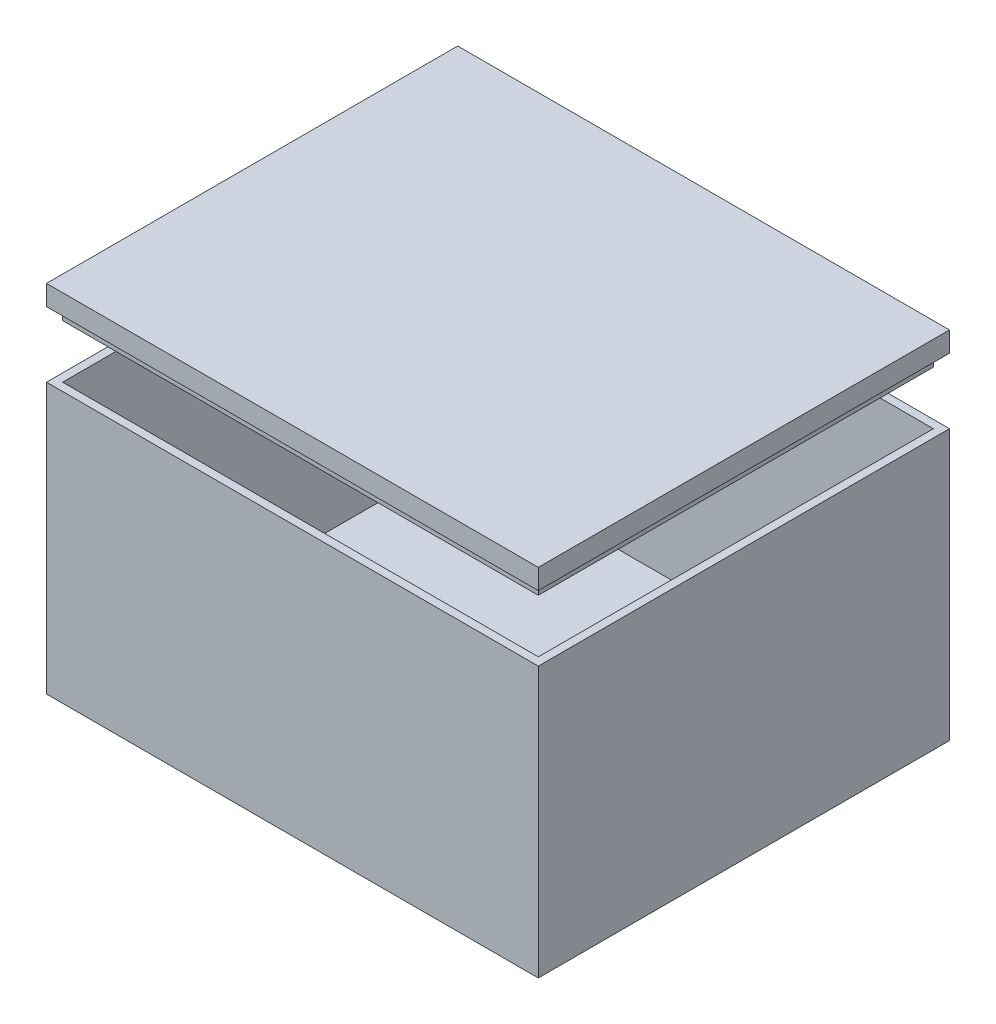
ISO-10303-21;
HEADER;
FILE_DESCRIPTION(('STEP AP214'),'2;1');
FILE_NAME('part.step','',(''),(''),'','','');
FILE_SCHEMA(('AUTOMOTIVE_DESIGN { 1 0 10303 214 1 1 1 1 }'));
ENDSEC;
DATA;
#1=APPLICATION_CONTEXT('core data for automotive mechanical design processes');
#2=APPLICATION_PROTOCOL_DEFINITION('international standard','automotive_design',2000,#1);
#3=PRODUCT_CONTEXT('',#1,'mechanical');
#4=PRODUCT('Part','Part','',(#3));
#5=PRODUCT_RELATED_PRODUCT_CATEGORY('part','',(#4));
#6=PRODUCT_DEFINITION_FORMATION('','',#4);
#7=PRODUCT_DEFINITION_CONTEXT('part definition',#1,'design');
#8=PRODUCT_DEFINITION('design','',#6,#7);
#9=PRODUCT_DEFINITION_SHAPE('','',#8);
#10=(LENGTH_UNIT() NAMED_UNIT(*) SI_UNIT(.MILLI.,.METRE.));
#11=(NAMED_UNIT(*) PLANE_ANGLE_UNIT() SI_UNIT($,.RADIAN.));
#12=(NAMED_UNIT(*) SI_UNIT($,.STERADIAN.) SOLID_ANGLE_UNIT());
#13=UNCERTAINTY_MEASURE_WITH_UNIT(LENGTH_MEASURE(1.E-05),#10,'distance_accuracy_value','');
#14=(GEOMETRIC_REPRESENTATION_CONTEXT(3) GLOBAL_UNCERTAINTY_ASSIGNED_CONTEXT((#13)) GLOBAL_UNIT_ASSIGNED_CONTEXT((#10,
#11,#12)) REPRESENTATION_CONTEXT('',''));
#15=CARTESIAN_POINT('',(0.,0.,0.));
#16=DIRECTION('',(0.,0.,1.));
#17=DIRECTION('',(1.,0.,0.));
#18=AXIS2_PLACEMENT_3D('',#15,#16,#17);
#19=CARTESIAN_POINT('',(0.,83.2232812478183,0.));
#20=DIRECTION('',(0.,1.,0.));
#21=DIRECTION('',(0.,0.,1.));
#22=AXIS2_PLACEMENT_3D('',#19,#20,#21);
#23=PLANE('',#22);
#24=DIRECTION('',(-1.,0.,0.));
#25=VECTOR('',#24,1.);
#26=CARTESIAN_POINT('',(67.4766734279919,83.2232812478183,-28.1135902636917));
#27=LINE('',#26,#25);
#28=CARTESIAN_POINT('',(67.4766734279919,83.2232812478183,-28.1135902636917));
#29=VERTEX_POINT('',#28);
#30=CARTESIAN_POINT('',(-54.5233265720081,83.2232812478183,-28.1135902636917));
#31=VERTEX_POINT('',#30);
#32=EDGE_CURVE('E227',#29,#31,#27,.T.);
#33=ORIENTED_EDGE('',*,*,#32,.F.);
#34=DIRECTION('',(0.,0.,-1.));
#35=VECTOR('',#34,1.);
#36=CARTESIAN_POINT('',(67.4766734279919,83.2232812478183,73.8864097363083));
#37=LINE('',#36,#35);
#38=CARTESIAN_POINT('',(67.4766734279919,83.2232812478183,73.8864097363083));
#39=VERTEX_POINT('',#38);
#40=EDGE_CURVE('E232',#39,#29,#37,.T.);
#41=ORIENTED_EDGE('',*,*,#40,.F.);
#42=DIRECTION('',(1.,0.,0.));
#43=VECTOR('',#42,1.);
#44=CARTESIAN_POINT('',(-54.5233265720081,83.2232812478183,73.8864097363083));
#45=LINE('',#44,#43);
#46=CARTESIAN_POINT('',(-54.5233265720081,83.2232812478183,73.8864097363083));
#47=VERTEX_POINT('',#46);
#48=EDGE_CURVE('E243',#47,#39,#45,.T.);
#49=ORIENTED_EDGE('',*,*,#48,.F.);
#50=DIRECTION('',(0.,0.,1.));
#51=VECTOR('',#50,1.);
#52=CARTESIAN_POINT('',(-54.5233265720081,83.2232812478183,-28.1135902636917));
#53=LINE('',#52,#51);
#54=EDGE_CURVE('E241',#31,#47,#53,.T.);
#55=ORIENTED_EDGE('',*,*,#54,.F.);
#56=EDGE_LOOP('',(#33,#41,#49,#55));
#57=FACE_BOUND('',#56,.T.);
#58=DIRECTION('',(0.,0.,-1.));
#59=VECTOR('',#58,1.);
#60=CARTESIAN_POINT('',(-52.5233265720081,83.2232812478183,71.8864097363083));
#61=LINE('',#60,#59);
#62=CARTESIAN_POINT('',(-52.5233265720081,83.2232812478183,71.8864097363083));
#63=VERTEX_POINT('',#62);
#64=CARTESIAN_POINT('',(-52.5233265720081,83.2232812478183,-26.1135902636917));
#65=VERTEX_POINT('',#64);
#66=EDGE_CURVE('E176',#63,#65,#61,.T.);
#67=ORIENTED_EDGE('',*,*,#66,.F.);
#68=DIRECTION('',(-1.,0.,0.));
#69=VECTOR('',#68,1.);
#70=CARTESIAN_POINT('',(65.4766734279919,83.2232812478183,71.8864097363083));
#71=LINE('',#70,#69);
#72=CARTESIAN_POINT('',(65.4766734279919,83.2232812478183,71.8864097363083));
#73=VERTEX_POINT('',#72);
#74=EDGE_CURVE('E204',#73,#63,#71,.T.);
#75=ORIENTED_EDGE('',*,*,#74,.F.);
#76=DIRECTION('',(0.,0.,1.));
#77=VECTOR('',#76,1.);
#78=CARTESIAN_POINT('',(65.4766734279919,83.2232812478183,-26.1135902636917));
#79=LINE('',#78,#77);
#80=CARTESIAN_POINT('',(65.4766734279919,83.2232812478183,-26.1135902636917));
#81=VERTEX_POINT('',#80);
#82=EDGE_CURVE('E90',#81,#73,#79,.T.);
#83=ORIENTED_EDGE('',*,*,#82,.F.);
#84=DIRECTION('',(1.,0.,0.));
#85=VECTOR('',#84,1.);
#86=CARTESIAN_POINT('',(-52.5233265720081,83.2232812478183,-26.1135902636917));
#87=LINE('',#86,#85);
#88=EDGE_CURVE('E85',#65,#81,#87,.T.);
#89=ORIENTED_EDGE('',*,*,#88,.F.);
#90=EDGE_LOOP('',(#67,#75,#83,#89));
#91=FACE_BOUND('',#90,.T.);
#92=ADVANCED_FACE('F70',(#57,#91),#23,.F.);
#93=CARTESIAN_POINT('',(67.4766734279919,88.2232812478183,-28.1135902636917));
#94=DIRECTION('',(0.,0.,1.));
#95=DIRECTION('',(1.,0.,0.));
#96=AXIS2_PLACEMENT_3D('',#93,#94,#95);
#97=PLANE('',#96);
#98=ORIENTED_EDGE('',*,*,#32,.T.);
#99=DIRECTION('',(0.,-1.,0.));
#100=VECTOR('',#99,1.);
#101=CARTESIAN_POINT('',(-54.5233265720081,88.2232812478183,-28.1135902636917));
#102=LINE('',#101,#100);
#103=CARTESIAN_POINT('',(-54.5233265720081,88.2232812478183,-28.1135902636917));
#104=VERTEX_POINT('',#103);
#105=EDGE_CURVE('E13',#104,#31,#102,.T.);
#106=ORIENTED_EDGE('',*,*,#105,.F.);
#107=DIRECTION('',(-1.,0.,0.));
#108=VECTOR('',#107,1.);
#109=CARTESIAN_POINT('',(67.4766734279919,88.2232812478183,-28.1135902636917));
#110=LINE('',#109,#108);
#111=CARTESIAN_POINT('',(67.4766734279919,88.2232812478183,-28.1135902636917));
#112=VERTEX_POINT('',#111);
#113=EDGE_CURVE('E228',#112,#104,#110,.T.);
#114=ORIENTED_EDGE('',*,*,#113,.F.);
#115=DIRECTION('',(0.,-1.,0.));
#116=VECTOR('',#115,1.);
#117=CARTESIAN_POINT('',(67.4766734279919,88.2232812478183,-28.1135902636917));
#118=LINE('',#117,#116);
#119=EDGE_CURVE('E238',#112,#29,#118,.T.);
#120=ORIENTED_EDGE('',*,*,#119,.T.);
#121=EDGE_LOOP('',(#98,#106,#114,#120));
#122=FACE_BOUND('',#121,.T.);
#123=ADVANCED_FACE('F72',(#122),#97,.F.);
#124=CARTESIAN_POINT('',(-54.5233265720081,88.2232812478183,-28.1135902636917));
#125=DIRECTION('',(1.,0.,0.));
#126=DIRECTION('',(0.,0.,-1.));
#127=AXIS2_PLACEMENT_3D('',#124,#125,#126);
#128=PLANE('',#127);
#129=ORIENTED_EDGE('',*,*,#54,.T.);
#130=DIRECTION('',(0.,-1.,0.));
#131=VECTOR('',#130,1.);
#132=CARTESIAN_POINT('',(-54.5233265720081,88.2232812478183,73.8864097363083));
#133=LINE('',#132,#131);
#134=CARTESIAN_POINT('',(-54.5233265720081,88.2232812478183,73.8864097363083));
#135=VERTEX_POINT('',#134);
#136=EDGE_CURVE('E78',#135,#47,#133,.T.);
#137=ORIENTED_EDGE('',*,*,#136,.F.);
#138=DIRECTION('',(0.,0.,1.));
#139=VECTOR('',#138,1.);
#140=CARTESIAN_POINT('',(-54.5233265720081,88.2232812478183,-28.1135902636917));
#141=LINE('',#140,#139);
#142=EDGE_CURVE('E231',#104,#135,#141,.T.);
#143=ORIENTED_EDGE('',*,*,#142,.F.);
#144=ORIENTED_EDGE('',*,*,#105,.T.);
#145=EDGE_LOOP('',(#129,#137,#143,#144));
#146=FACE_BOUND('',#145,.T.);
#147=ADVANCED_FACE('F270',(#146),#128,.F.);
#148=CARTESIAN_POINT('',(-54.5233265720081,88.2232812478183,73.8864097363083));
#149=DIRECTION('',(0.,0.,-1.));
#150=DIRECTION('',(-1.,0.,0.));
#151=AXIS2_PLACEMENT_3D('',#148,#149,#150);
#152=PLANE('',#151);
#153=ORIENTED_EDGE('',*,*,#48,.T.);
#154=DIRECTION('',(0.,-1.,0.));
#155=VECTOR('',#154,1.);
#156=CARTESIAN_POINT('',(67.4766734279919,88.2232812478183,73.8864097363083));
#157=LINE('',#156,#155);
#158=CARTESIAN_POINT('',(67.4766734279919,88.2232812478183,73.8864097363083));
#159=VERTEX_POINT('',#158);
#160=EDGE_CURVE('E248',#159,#39,#157,.T.);
#161=ORIENTED_EDGE('',*,*,#160,.F.);
#162=DIRECTION('',(1.,0.,0.));
#163=VECTOR('',#162,1.);
#164=CARTESIAN_POINT('',(-54.5233265720081,88.2232812478183,73.8864097363083));
#165=LINE('',#164,#163);
#166=EDGE_CURVE('E234',#135,#159,#165,.T.);
#167=ORIENTED_EDGE('',*,*,#166,.F.);
#168=ORIENTED_EDGE('',*,*,#136,.T.);
#169=EDGE_LOOP('',(#153,#161,#167,#168));
#170=FACE_BOUND('',#169,.T.);
#171=ADVANCED_FACE('F255',(#170),#152,.F.);
#172=CARTESIAN_POINT('',(67.4766734279919,88.2232812478183,73.8864097363083));
#173=DIRECTION('',(-1.,0.,0.));
#174=DIRECTION('',(0.,0.,1.));
#175=AXIS2_PLACEMENT_3D('',#172,#173,#174);
#176=PLANE('',#175);
#177=ORIENTED_EDGE('',*,*,#40,.T.);
#178=ORIENTED_EDGE('',*,*,#119,.F.);
#179=DIRECTION('',(0.,0.,-1.));
#180=VECTOR('',#179,1.);
#181=CARTESIAN_POINT('',(67.4766734279919,88.2232812478183,73.8864097363083));
#182=LINE('',#181,#180);
#183=EDGE_CURVE('E236',#159,#112,#182,.T.);
#184=ORIENTED_EDGE('',*,*,#183,.F.);
#185=ORIENTED_EDGE('',*,*,#160,.T.);
#186=EDGE_LOOP('',(#177,#178,#184,#185));
#187=FACE_BOUND('',#186,.T.);
#188=ADVANCED_FACE('F263',(#187),#176,.F.);
#189=CARTESIAN_POINT('',(0.,88.2232812478183,0.));
#190=DIRECTION('',(0.,1.,0.));
#191=DIRECTION('',(0.,0.,1.));
#192=AXIS2_PLACEMENT_3D('',#189,#190,#191);
#193=PLANE('',#192);
#194=ORIENTED_EDGE('',*,*,#113,.T.);
#195=ORIENTED_EDGE('',*,*,#142,.T.);
#196=ORIENTED_EDGE('',*,*,#166,.T.);
#197=ORIENTED_EDGE('',*,*,#183,.T.);
#198=EDGE_LOOP('',(#194,#195,#196,#197));
#199=FACE_BOUND('',#198,.T.);
#200=ADVANCED_FACE('F269',(#199),#193,.T.);
#201=CARTESIAN_POINT('',(0.,80.2232812478183,0.));
#202=DIRECTION('',(0.,-1.,0.));
#203=DIRECTION('',(0.,0.,-1.));
#204=AXIS2_PLACEMENT_3D('',#201,#202,#203);
#205=PLANE('',#204);
#206=DIRECTION('',(0.,0.,-1.));
#207=VECTOR('',#206,1.);
#208=CARTESIAN_POINT('',(-52.5233265720081,80.2232812478183,71.8864097363083));
#209=LINE('',#208,#207);
#210=CARTESIAN_POINT('',(-52.5233265720081,80.2232812478183,71.8864097363083));
#211=VERTEX_POINT('',#210);
#212=CARTESIAN_POINT('',(-52.5233265720081,80.2232812478183,-26.1135902636917));
#213=VERTEX_POINT('',#212);
#214=EDGE_CURVE('E200',#211,#213,#209,.T.);
#215=ORIENTED_EDGE('',*,*,#214,.T.);
#216=DIRECTION('',(1.,0.,0.));
#217=VECTOR('',#216,1.);
#218=CARTESIAN_POINT('',(-52.5233265720081,80.2232812478183,-26.1135902636917));
#219=LINE('',#218,#217);
#220=CARTESIAN_POINT('',(65.4766734279919,80.2232812478183,-26.1135902636917));
#221=VERTEX_POINT('',#220);
#222=EDGE_CURVE('E203',#213,#221,#219,.T.);
#223=ORIENTED_EDGE('',*,*,#222,.T.);
#224=DIRECTION('',(0.,0.,1.));
#225=VECTOR('',#224,1.);
#226=CARTESIAN_POINT('',(65.4766734279919,80.2232812478183,-26.1135902636917));
#227=LINE('',#226,#225);
#228=CARTESIAN_POINT('',(65.4766734279919,80.2232812478183,71.8864097363083));
#229=VERTEX_POINT('',#228);
#230=EDGE_CURVE('E206',#221,#229,#227,.T.);
#231=ORIENTED_EDGE('',*,*,#230,.T.);
#232=DIRECTION('',(-1.,0.,0.));
#233=VECTOR('',#232,1.);
#234=CARTESIAN_POINT('',(65.4766734279919,80.2232812478183,71.8864097363083));
#235=LINE('',#234,#233);
#236=EDGE_CURVE('E208',#229,#211,#235,.T.);
#237=ORIENTED_EDGE('',*,*,#236,.T.);
#238=EDGE_LOOP('',(#215,#223,#231,#237));
#239=FACE_BOUND('',#238,.T.);
#240=DIRECTION('',(1.,0.,0.));
#241=VECTOR('',#240,1.);
#242=CARTESIAN_POINT('',(-52.5233265720081,80.2232812478183,-24.1135902636917));
#243=LINE('',#242,#241);
#244=CARTESIAN_POINT('',(-50.5233265720081,80.2232812478183,-24.1135902636917));
#245=VERTEX_POINT('',#244);
#246=CARTESIAN_POINT('',(63.4766734279919,80.2232812478183,-24.1135902636917));
#247=VERTEX_POINT('',#246);
#248=EDGE_CURVE('E168',#245,#247,#243,.T.);
#249=ORIENTED_EDGE('',*,*,#248,.F.);
#250=DIRECTION('',(0.,0.,-1.));
#251=VECTOR('',#250,1.);
#252=CARTESIAN_POINT('',(-50.5233265720081,80.2232812478183,71.8864097363083));
#253=LINE('',#252,#251);
#254=CARTESIAN_POINT('',(-50.5233265720081,80.2232812478183,69.8864097363083));
#255=VERTEX_POINT('',#254);
#256=EDGE_CURVE('E158',#255,#245,#253,.T.);
#257=ORIENTED_EDGE('',*,*,#256,.F.);
#258=DIRECTION('',(-1.,0.,0.));
#259=VECTOR('',#258,1.);
#260=CARTESIAN_POINT('',(65.4766734279919,80.2232812478183,69.8864097363083));
#261=LINE('',#260,#259);
#262=CARTESIAN_POINT('',(63.4766734279919,80.2232812478183,69.8864097363083));
#263=VERTEX_POINT('',#262);
#264=EDGE_CURVE('E184',#263,#255,#261,.T.);
#265=ORIENTED_EDGE('',*,*,#264,.F.);
#266=DIRECTION('',(0.,0.,1.));
#267=VECTOR('',#266,1.);
#268=CARTESIAN_POINT('',(63.4766734279919,80.2232812478183,-26.1135902636917));
#269=LINE('',#268,#267);
#270=EDGE_CURVE('E182',#247,#263,#269,.T.);
#271=ORIENTED_EDGE('',*,*,#270,.F.);
#272=EDGE_LOOP('',(#249,#257,#265,#271));
#273=FACE_BOUND('',#272,.T.);
#274=ADVANCED_FACE('F180',(#239,#273),#205,.T.);
#275=CARTESIAN_POINT('',(-52.5233265720081,80.2232812478183,71.8864097363083));
#276=DIRECTION('',(1.,0.,0.));
#277=DIRECTION('',(0.,0.,-1.));
#278=AXIS2_PLACEMENT_3D('',#275,#276,#277);
#279=PLANE('',#278);
#280=ORIENTED_EDGE('',*,*,#66,.T.);
#281=DIRECTION('',(0.,1.,0.));
#282=VECTOR('',#281,1.);
#283=CARTESIAN_POINT('',(-52.5233265720081,80.2232812478183,-26.1135902636917));
#284=LINE('',#283,#282);
#285=EDGE_CURVE('E225',#213,#65,#284,.T.);
#286=ORIENTED_EDGE('',*,*,#285,.F.);
#287=ORIENTED_EDGE('',*,*,#214,.F.);
#288=DIRECTION('',(0.,1.,0.));
#289=VECTOR('',#288,1.);
#290=CARTESIAN_POINT('',(-52.5233265720081,80.2232812478183,71.8864097363083));
#291=LINE('',#290,#289);
#292=EDGE_CURVE('E210',#211,#63,#291,.T.);
#293=ORIENTED_EDGE('',*,*,#292,.T.);
#294=EDGE_LOOP('',(#280,#286,#287,#293));
#295=FACE_BOUND('',#294,.T.);
#296=ADVANCED_FACE('F308',(#295),#279,.F.);
#297=CARTESIAN_POINT('',(-52.5233265720081,80.2232812478183,-26.1135902636917));
#298=DIRECTION('',(0.,0.,1.));
#299=DIRECTION('',(1.,0.,0.));
#300=AXIS2_PLACEMENT_3D('',#297,#298,#299);
#301=PLANE('',#300);
#302=ORIENTED_EDGE('',*,*,#88,.T.);
#303=DIRECTION('',(0.,1.,0.));
#304=VECTOR('',#303,1.);
#305=CARTESIAN_POINT('',(65.4766734279919,80.2232812478183,-26.1135902636917));
#306=LINE('',#305,#304);
#307=EDGE_CURVE('E222',#221,#81,#306,.T.);
#308=ORIENTED_EDGE('',*,*,#307,.F.);
#309=ORIENTED_EDGE('',*,*,#222,.F.);
#310=ORIENTED_EDGE('',*,*,#285,.T.);
#311=EDGE_LOOP('',(#302,#308,#309,#310));
#312=FACE_BOUND('',#311,.T.);
#313=ADVANCED_FACE('F316',(#312),#301,.F.);
#314=CARTESIAN_POINT('',(65.4766734279919,80.2232812478183,-26.1135902636917));
#315=DIRECTION('',(-1.,0.,0.));
#316=DIRECTION('',(0.,0.,1.));
#317=AXIS2_PLACEMENT_3D('',#314,#315,#316);
#318=PLANE('',#317);
#319=ORIENTED_EDGE('',*,*,#82,.T.);
#320=DIRECTION('',(0.,1.,0.));
#321=VECTOR('',#320,1.);
#322=CARTESIAN_POINT('',(65.4766734279919,80.2232812478183,71.8864097363083));
#323=LINE('',#322,#321);
#324=EDGE_CURVE('E219',#229,#73,#323,.T.);
#325=ORIENTED_EDGE('',*,*,#324,.F.);
#326=ORIENTED_EDGE('',*,*,#230,.F.);
#327=ORIENTED_EDGE('',*,*,#307,.T.);
#328=EDGE_LOOP('',(#319,#325,#326,#327));
#329=FACE_BOUND('',#328,.T.);
#330=ADVANCED_FACE('F312',(#329),#318,.F.);
#331=CARTESIAN_POINT('',(65.4766734279919,80.2232812478183,71.8864097363083));
#332=DIRECTION('',(0.,0.,-1.));
#333=DIRECTION('',(-1.,0.,0.));
#334=AXIS2_PLACEMENT_3D('',#331,#332,#333);
#335=PLANE('',#334);
#336=ORIENTED_EDGE('',*,*,#74,.T.);
#337=ORIENTED_EDGE('',*,*,#292,.F.);
#338=ORIENTED_EDGE('',*,*,#236,.F.);
#339=ORIENTED_EDGE('',*,*,#324,.T.);
#340=EDGE_LOOP('',(#336,#337,#338,#339));
#341=FACE_BOUND('',#340,.T.);
#342=ADVANCED_FACE('F305',(#341),#335,.F.);
#343=CARTESIAN_POINT('',(-50.5233265720081,80.2232812478183,71.8864097363083));
#344=DIRECTION('',(1.,0.,0.));
#345=DIRECTION('',(0.,0.,-1.));
#346=AXIS2_PLACEMENT_3D('',#343,#344,#345);
#347=PLANE('',#346);
#348=DIRECTION('',(0.,0.,-1.));
#349=VECTOR('',#348,1.);
#350=CARTESIAN_POINT('',(-50.5233265720081,83.2232812478183,71.8864097363083));
#351=LINE('',#350,#349);
#352=CARTESIAN_POINT('',(-50.5233265720081,83.2232812478183,69.8864097363083));
#353=VERTEX_POINT('',#352);
#354=CARTESIAN_POINT('',(-50.5233265720081,83.2232812478183,-24.1135902636917));
#355=VERTEX_POINT('',#354);
#356=EDGE_CURVE('E188',#353,#355,#351,.T.);
#357=ORIENTED_EDGE('',*,*,#356,.F.);
#358=DIRECTION('',(0.,1.,0.));
#359=VECTOR('',#358,1.);
#360=CARTESIAN_POINT('',(-50.5233265720081,80.2232812478183,69.8864097363083));
#361=LINE('',#360,#359);
#362=EDGE_CURVE('E164',#255,#353,#361,.T.);
#363=ORIENTED_EDGE('',*,*,#362,.F.);
#364=ORIENTED_EDGE('',*,*,#256,.T.);
#365=DIRECTION('',(0.,1.,0.));
#366=VECTOR('',#365,1.);
#367=CARTESIAN_POINT('',(-50.5233265720081,80.2232812478183,-24.1135902636917));
#368=LINE('',#367,#366);
#369=EDGE_CURVE('E162',#245,#355,#368,.T.);
#370=ORIENTED_EDGE('',*,*,#369,.T.);
#371=EDGE_LOOP('',(#357,#363,#364,#370));
#372=FACE_BOUND('',#371,.T.);
#373=ADVANCED_FACE('F161',(#372),#347,.T.);
#374=CARTESIAN_POINT('',(-52.5233265720081,80.2232812478183,-24.1135902636917));
#375=DIRECTION('',(0.,0.,1.));
#376=DIRECTION('',(1.,0.,0.));
#377=AXIS2_PLACEMENT_3D('',#374,#375,#376);
#378=PLANE('',#377);
#379=DIRECTION('',(1.,0.,0.));
#380=VECTOR('',#379,1.);
#381=CARTESIAN_POINT('',(-52.5233265720081,83.2232812478183,-24.1135902636917));
#382=LINE('',#381,#380);
#383=CARTESIAN_POINT('',(63.4766734279919,83.2232812478183,-24.1135902636917));
#384=VERTEX_POINT('',#383);
#385=EDGE_CURVE('E175',#355,#384,#382,.T.);
#386=ORIENTED_EDGE('',*,*,#385,.F.);
#387=ORIENTED_EDGE('',*,*,#369,.F.);
#388=ORIENTED_EDGE('',*,*,#248,.T.);
#389=DIRECTION('',(0.,1.,0.));
#390=VECTOR('',#389,1.);
#391=CARTESIAN_POINT('',(63.4766734279919,80.2232812478183,-24.1135902636917));
#392=LINE('',#391,#390);
#393=EDGE_CURVE('E177',#247,#384,#392,.T.);
#394=ORIENTED_EDGE('',*,*,#393,.T.);
#395=EDGE_LOOP('',(#386,#387,#388,#394));
#396=FACE_BOUND('',#395,.T.);
#397=ADVANCED_FACE('F172',(#396),#378,.T.);
#398=CARTESIAN_POINT('',(63.4766734279919,80.2232812478183,-26.1135902636917));
#399=DIRECTION('',(-1.,0.,0.));
#400=DIRECTION('',(0.,0.,1.));
#401=AXIS2_PLACEMENT_3D('',#398,#399,#400);
#402=PLANE('',#401);
#403=DIRECTION('',(0.,0.,1.));
#404=VECTOR('',#403,1.);
#405=CARTESIAN_POINT('',(63.4766734279919,83.2232812478183,-26.1135902636917));
#406=LINE('',#405,#404);
#407=CARTESIAN_POINT('',(63.4766734279919,83.2232812478183,69.8864097363083));
#408=VERTEX_POINT('',#407);
#409=EDGE_CURVE('E191',#384,#408,#406,.T.);
#410=ORIENTED_EDGE('',*,*,#409,.F.);
#411=ORIENTED_EDGE('',*,*,#393,.F.);
#412=ORIENTED_EDGE('',*,*,#270,.T.);
#413=DIRECTION('',(0.,1.,0.));
#414=VECTOR('',#413,1.);
#415=CARTESIAN_POINT('',(63.4766734279919,80.2232812478183,69.8864097363083));
#416=LINE('',#415,#414);
#417=EDGE_CURVE('E197',#263,#408,#416,.T.);
#418=ORIENTED_EDGE('',*,*,#417,.T.);
#419=EDGE_LOOP('',(#410,#411,#412,#418));
#420=FACE_BOUND('',#419,.T.);
#421=ADVANCED_FACE('F290',(#420),#402,.T.);
#422=CARTESIAN_POINT('',(65.4766734279919,80.2232812478183,69.8864097363083));
#423=DIRECTION('',(0.,0.,-1.));
#424=DIRECTION('',(-1.,0.,0.));
#425=AXIS2_PLACEMENT_3D('',#422,#423,#424);
#426=PLANE('',#425);
#427=DIRECTION('',(-1.,0.,0.));
#428=VECTOR('',#427,1.);
#429=CARTESIAN_POINT('',(65.4766734279919,83.2232812478183,69.8864097363083));
#430=LINE('',#429,#428);
#431=EDGE_CURVE('E169',#408,#353,#430,.T.);
#432=ORIENTED_EDGE('',*,*,#431,.F.);
#433=ORIENTED_EDGE('',*,*,#417,.F.);
#434=ORIENTED_EDGE('',*,*,#264,.T.);
#435=ORIENTED_EDGE('',*,*,#362,.T.);
#436=EDGE_LOOP('',(#432,#433,#434,#435));
#437=FACE_BOUND('',#436,.T.);
#438=ADVANCED_FACE('F285',(#437),#426,.T.);
#439=ORIENTED_EDGE('',*,*,#431,.T.);
#440=ORIENTED_EDGE('',*,*,#356,.T.);
#441=ORIENTED_EDGE('',*,*,#385,.T.);
#442=ORIENTED_EDGE('',*,*,#409,.T.);
#443=EDGE_LOOP('',(#439,#440,#441,#442));
#444=FACE_BOUND('',#443,.T.);
#445=ADVANCED_FACE('F279',(#444),#23,.F.);
#446=CLOSED_SHELL('',(#92,#123,#147,#171,#188,#200,#274,#296,#313,#330,#342,#373,#397,#421,#438,#445));
#447=MANIFOLD_SOLID_BREP('B2',#446);
#448=CARTESIAN_POINT('',(0.,67.,0.));
#449=DIRECTION('',(0.,1.,0.));
#450=DIRECTION('',(0.,0.,1.));
#451=AXIS2_PLACEMENT_3D('',#448,#449,#450);
#452=PLANE('',#451);
#453=DIRECTION('',(0.,0.,1.));
#454=VECTOR('',#453,1.);
#455=CARTESIAN_POINT('',(-52.5233265720081,67.,-28.1135902636917));
#456=LINE('',#455,#454);
#457=CARTESIAN_POINT('',(-52.5233265720081,67.,-26.1135902636917));
#458=VERTEX_POINT('',#457);
#459=CARTESIAN_POINT('',(-52.5233265720081,67.,71.8864097363083));
#460=VERTEX_POINT('',#459);
#461=EDGE_CURVE('E519',#458,#460,#456,.T.);
#462=ORIENTED_EDGE('',*,*,#461,.F.);
#463=DIRECTION('',(-1.,0.,0.));
#464=VECTOR('',#463,1.);
#465=CARTESIAN_POINT('',(-54.5233265720081,67.,-26.1135902636917));
#466=LINE('',#465,#464);
#467=CARTESIAN_POINT('',(65.4766734279919,67.,-26.1135902636917));
#468=VERTEX_POINT('',#467);
#469=EDGE_CURVE('E528',#468,#458,#466,.T.);
#470=ORIENTED_EDGE('',*,*,#469,.F.);
#471=DIRECTION('',(0.,0.,-1.));
#472=VECTOR('',#471,1.);
#473=CARTESIAN_POINT('',(65.4766734279919,67.,-28.1135902636917));
#474=LINE('',#473,#472);
#475=CARTESIAN_POINT('',(65.4766734279919,67.,71.8864097363083));
#476=VERTEX_POINT('',#475);
#477=EDGE_CURVE('E526',#476,#468,#474,.T.);
#478=ORIENTED_EDGE('',*,*,#477,.F.);
#479=DIRECTION('',(1.,0.,0.));
#480=VECTOR('',#479,1.);
#481=CARTESIAN_POINT('',(-54.5233265720081,67.,71.8864097363083));
#482=LINE('',#481,#480);
#483=EDGE_CURVE('E511',#460,#476,#482,.T.);
#484=ORIENTED_EDGE('',*,*,#483,.F.);
#485=EDGE_LOOP('',(#462,#470,#478,#484));
#486=FACE_BOUND('',#485,.T.);
#487=DIRECTION('',(0.,0.,1.));
#488=VECTOR('',#487,1.);
#489=CARTESIAN_POINT('',(-54.5233265720081,67.,-28.1135902636917));
#490=LINE('',#489,#488);
#491=CARTESIAN_POINT('',(-54.5233265720081,67.,-28.1135902636917));
#492=VERTEX_POINT('',#491);
#493=CARTESIAN_POINT('',(-54.5233265720081,67.,73.8864097363083));
#494=VERTEX_POINT('',#493);
#495=EDGE_CURVE('E530',#492,#494,#490,.T.);
#496=ORIENTED_EDGE('',*,*,#495,.T.);
#497=DIRECTION('',(1.,0.,0.));
#498=VECTOR('',#497,1.);
#499=CARTESIAN_POINT('',(-54.5233265720081,67.,73.8864097363083));
#500=LINE('',#499,#498);
#501=CARTESIAN_POINT('',(67.4766734279919,67.,73.8864097363083));
#502=VERTEX_POINT('',#501);
#503=EDGE_CURVE('E474',#494,#502,#500,.T.);
#504=ORIENTED_EDGE('',*,*,#503,.T.);
#505=DIRECTION('',(0.,0.,-1.));
#506=VECTOR('',#505,1.);
#507=CARTESIAN_POINT('',(67.4766734279919,67.,-28.1135902636917));
#508=LINE('',#507,#506);
#509=CARTESIAN_POINT('',(67.4766734279919,67.,-28.1135902636917));
#510=VERTEX_POINT('',#509);
#511=EDGE_CURVE('E533',#502,#510,#508,.T.);
#512=ORIENTED_EDGE('',*,*,#511,.T.);
#513=DIRECTION('',(-1.,0.,0.));
#514=VECTOR('',#513,1.);
#515=CARTESIAN_POINT('',(-54.5233265720081,67.,-28.1135902636917));
#516=LINE('',#515,#514);
#517=EDGE_CURVE('E446',#510,#492,#516,.T.);
#518=ORIENTED_EDGE('',*,*,#517,.T.);
#519=EDGE_LOOP('',(#496,#504,#512,#518));
#520=FACE_BOUND('',#519,.T.);
#521=ADVANCED_FACE('F422',(#486,#520),#452,.T.);
#522=CARTESIAN_POINT('',(-54.5233265720081,67.,71.8864097363083));
#523=DIRECTION('',(0.,0.,-1.));
#524=DIRECTION('',(-1.,0.,0.));
#525=AXIS2_PLACEMENT_3D('',#522,#523,#524);
#526=PLANE('',#525);
#527=DIRECTION('',(1.,0.,0.));
#528=VECTOR('',#527,1.);
#529=CARTESIAN_POINT('',(-54.5233265720081,2.,71.8864097363083));
#530=LINE('',#529,#528);
#531=CARTESIAN_POINT('',(-52.5233265720081,2.,71.8864097363083));
#532=VERTEX_POINT('',#531);
#533=CARTESIAN_POINT('',(65.4766734279919,2.,71.8864097363083));
#534=VERTEX_POINT('',#533);
#535=EDGE_CURVE('E496',#532,#534,#530,.T.);
#536=ORIENTED_EDGE('',*,*,#535,.F.);
#537=DIRECTION('',(0.,-1.,0.));
#538=VECTOR('',#537,1.);
#539=CARTESIAN_POINT('',(-52.5233265720081,67.,71.8864097363083));
#540=LINE('',#539,#538);
#541=EDGE_CURVE('E514',#460,#532,#540,.T.);
#542=ORIENTED_EDGE('',*,*,#541,.F.);
#543=ORIENTED_EDGE('',*,*,#483,.T.);
#544=DIRECTION('',(0.,-1.,0.));
#545=VECTOR('',#544,1.);
#546=CARTESIAN_POINT('',(65.4766734279919,67.,71.8864097363083));
#547=LINE('',#546,#545);
#548=EDGE_CURVE('E508',#476,#534,#547,.T.);
#549=ORIENTED_EDGE('',*,*,#548,.T.);
#550=EDGE_LOOP('',(#536,#542,#543,#549));
#551=FACE_BOUND('',#550,.T.);
#552=ADVANCED_FACE('F509',(#551),#526,.T.);
#553=CARTESIAN_POINT('',(-52.5233265720081,67.,-28.1135902636917));
#554=DIRECTION('',(1.,0.,0.));
#555=DIRECTION('',(0.,0.,-1.));
#556=AXIS2_PLACEMENT_3D('',#553,#554,#555);
#557=PLANE('',#556);
#558=DIRECTION('',(0.,0.,1.));
#559=VECTOR('',#558,1.);
#560=CARTESIAN_POINT('',(-52.5233265720081,2.,-28.1135902636917));
#561=LINE('',#560,#559);
#562=CARTESIAN_POINT('',(-52.5233265720081,2.,-26.1135902636917));
#563=VERTEX_POINT('',#562);
#564=EDGE_CURVE('E502',#563,#532,#561,.T.);
#565=ORIENTED_EDGE('',*,*,#564,.F.);
#566=DIRECTION('',(0.,-1.,0.));
#567=VECTOR('',#566,1.);
#568=CARTESIAN_POINT('',(-52.5233265720081,67.,-26.1135902636917));
#569=LINE('',#568,#567);
#570=EDGE_CURVE('E522',#458,#563,#569,.T.);
#571=ORIENTED_EDGE('',*,*,#570,.F.);
#572=ORIENTED_EDGE('',*,*,#461,.T.);
#573=ORIENTED_EDGE('',*,*,#541,.T.);
#574=EDGE_LOOP('',(#565,#571,#572,#573));
#575=FACE_BOUND('',#574,.T.);
#576=ADVANCED_FACE('F570',(#575),#557,.T.);
#577=CARTESIAN_POINT('',(65.4766734279919,67.,-28.1135902636917));
#578=DIRECTION('',(-1.,0.,0.));
#579=DIRECTION('',(0.,0.,1.));
#580=AXIS2_PLACEMENT_3D('',#577,#578,#579);
#581=PLANE('',#580);
#582=DIRECTION('',(0.,0.,-1.));
#583=VECTOR('',#582,1.);
#584=CARTESIAN_POINT('',(65.4766734279919,2.,-28.1135902636917));
#585=LINE('',#584,#583);
#586=CARTESIAN_POINT('',(65.4766734279919,2.,-26.1135902636917));
#587=VERTEX_POINT('',#586);
#588=EDGE_CURVE('E500',#534,#587,#585,.T.);
#589=ORIENTED_EDGE('',*,*,#588,.F.);
#590=ORIENTED_EDGE('',*,*,#548,.F.);
#591=ORIENTED_EDGE('',*,*,#477,.T.);
#592=DIRECTION('',(0.,-1.,0.));
#593=VECTOR('',#592,1.);
#594=CARTESIAN_POINT('',(65.4766734279919,67.,-26.1135902636917));
#595=LINE('',#594,#593);
#596=EDGE_CURVE('E437',#468,#587,#595,.T.);
#597=ORIENTED_EDGE('',*,*,#596,.T.);
#598=EDGE_LOOP('',(#589,#590,#591,#597));
#599=FACE_BOUND('',#598,.T.);
#600=ADVANCED_FACE('F516',(#599),#581,.T.);
#601=CARTESIAN_POINT('',(0.,2.,0.));
#602=DIRECTION('',(0.,1.,0.));
#603=DIRECTION('',(0.,0.,1.));
#604=AXIS2_PLACEMENT_3D('',#601,#602,#603);
#605=PLANE('',#604);
#606=ORIENTED_EDGE('',*,*,#564,.T.);
#607=ORIENTED_EDGE('',*,*,#535,.T.);
#608=ORIENTED_EDGE('',*,*,#588,.T.);
#609=DIRECTION('',(-1.,0.,0.));
#610=VECTOR('',#609,1.);
#611=CARTESIAN_POINT('',(-54.5233265720081,2.,-26.1135902636917));
#612=LINE('',#611,#610);
#613=EDGE_CURVE('E517',#587,#563,#612,.T.);
#614=ORIENTED_EDGE('',*,*,#613,.T.);
#615=EDGE_LOOP('',(#606,#607,#608,#614));
#616=FACE_BOUND('',#615,.T.);
#617=ADVANCED_FACE('F498',(#616),#605,.T.);
#618=CARTESIAN_POINT('',(-54.5233265720081,67.,-26.1135902636917));
#619=DIRECTION('',(0.,0.,1.));
#620=DIRECTION('',(1.,0.,0.));
#621=AXIS2_PLACEMENT_3D('',#618,#619,#620);
#622=PLANE('',#621);
#623=ORIENTED_EDGE('',*,*,#613,.F.);
#624=ORIENTED_EDGE('',*,*,#596,.F.);
#625=ORIENTED_EDGE('',*,*,#469,.T.);
#626=ORIENTED_EDGE('',*,*,#570,.T.);
#627=EDGE_LOOP('',(#623,#624,#625,#626));
#628=FACE_BOUND('',#627,.T.);
#629=ADVANCED_FACE('F580',(#628),#622,.T.);
#630=CARTESIAN_POINT('',(-54.5233265720081,67.,-28.1135902636917));
#631=DIRECTION('',(1.,0.,0.));
#632=DIRECTION('',(0.,0.,-1.));
#633=AXIS2_PLACEMENT_3D('',#630,#631,#632);
#634=PLANE('',#633);
#635=DIRECTION('',(0.,0.,1.));
#636=VECTOR('',#635,1.);
#637=CARTESIAN_POINT('',(-54.5233265720081,0.,-28.1135902636917));
#638=LINE('',#637,#636);
#639=CARTESIAN_POINT('',(-54.5233265720081,0.,-28.1135902636917));
#640=VERTEX_POINT('',#639);
#641=CARTESIAN_POINT('',(-54.5233265720081,0.,73.8864097363083));
#642=VERTEX_POINT('',#641);
#643=EDGE_CURVE('E537',#640,#642,#638,.T.);
#644=ORIENTED_EDGE('',*,*,#643,.T.);
#645=DIRECTION('',(0.,-1.,0.));
#646=VECTOR('',#645,1.);
#647=CARTESIAN_POINT('',(-54.5233265720081,67.,73.8864097363083));
#648=LINE('',#647,#646);
#649=EDGE_CURVE('E68',#494,#642,#648,.T.);
#650=ORIENTED_EDGE('',*,*,#649,.F.);
#651=ORIENTED_EDGE('',*,*,#495,.F.);
#652=DIRECTION('',(0.,-1.,0.));
#653=VECTOR('',#652,1.);
#654=CARTESIAN_POINT('',(-54.5233265720081,67.,-28.1135902636917));
#655=LINE('',#654,#653);
#656=EDGE_CURVE('E536',#492,#640,#655,.T.);
#657=ORIENTED_EDGE('',*,*,#656,.T.);
#658=EDGE_LOOP('',(#644,#650,#651,#657));
#659=FACE_BOUND('',#658,.T.);
#660=ADVANCED_FACE('F424',(#659),#634,.F.);
#661=CARTESIAN_POINT('',(-54.5233265720081,67.,73.8864097363083));
#662=DIRECTION('',(0.,0.,-1.));
#663=DIRECTION('',(-1.,0.,0.));
#664=AXIS2_PLACEMENT_3D('',#661,#662,#663);
#665=PLANE('',#664);
#666=DIRECTION('',(1.,0.,0.));
#667=VECTOR('',#666,1.);
#668=CARTESIAN_POINT('',(-54.5233265720081,0.,73.8864097363083));
#669=LINE('',#668,#667);
#670=CARTESIAN_POINT('',(67.4766734279919,0.,73.8864097363083));
#671=VERTEX_POINT('',#670);
#672=EDGE_CURVE('E540',#642,#671,#669,.T.);
#673=ORIENTED_EDGE('',*,*,#672,.T.);
#674=DIRECTION('',(0.,-1.,0.));
#675=VECTOR('',#674,1.);
#676=CARTESIAN_POINT('',(67.4766734279919,67.,73.8864097363083));
#677=LINE('',#676,#675);
#678=EDGE_CURVE('E430',#502,#671,#677,.T.);
#679=ORIENTED_EDGE('',*,*,#678,.F.);
#680=ORIENTED_EDGE('',*,*,#503,.F.);
#681=ORIENTED_EDGE('',*,*,#649,.T.);
#682=EDGE_LOOP('',(#673,#679,#680,#681));
#683=FACE_BOUND('',#682,.T.);
#684=ADVANCED_FACE('F567',(#683),#665,.F.);
#685=CARTESIAN_POINT('',(67.4766734279919,67.,-28.1135902636917));
#686=DIRECTION('',(-1.,0.,0.));
#687=DIRECTION('',(0.,0.,1.));
#688=AXIS2_PLACEMENT_3D('',#685,#686,#687);
#689=PLANE('',#688);
#690=DIRECTION('',(0.,0.,-1.));
#691=VECTOR('',#690,1.);
#692=CARTESIAN_POINT('',(67.4766734279919,0.,-28.1135902636917));
#693=LINE('',#692,#691);
#694=CARTESIAN_POINT('',(67.4766734279919,0.,-28.1135902636917));
#695=VERTEX_POINT('',#694);
#696=EDGE_CURVE('E542',#671,#695,#693,.T.);
#697=ORIENTED_EDGE('',*,*,#696,.T.);
#698=DIRECTION('',(0.,-1.,0.));
#699=VECTOR('',#698,1.);
#700=CARTESIAN_POINT('',(67.4766734279919,67.,-28.1135902636917));
#701=LINE('',#700,#699);
#702=EDGE_CURVE('E546',#510,#695,#701,.T.);
#703=ORIENTED_EDGE('',*,*,#702,.F.);
#704=ORIENTED_EDGE('',*,*,#511,.F.);
#705=ORIENTED_EDGE('',*,*,#678,.T.);
#706=EDGE_LOOP('',(#697,#703,#704,#705));
#707=FACE_BOUND('',#706,.T.);
#708=ADVANCED_FACE('F551',(#707),#689,.F.);
#709=CARTESIAN_POINT('',(-54.5233265720081,67.,-28.1135902636917));
#710=DIRECTION('',(0.,0.,1.));
#711=DIRECTION('',(1.,0.,0.));
#712=AXIS2_PLACEMENT_3D('',#709,#710,#711);
#713=PLANE('',#712);
#714=DIRECTION('',(-1.,0.,0.));
#715=VECTOR('',#714,1.);
#716=CARTESIAN_POINT('',(-54.5233265720081,0.,-28.1135902636917));
#717=LINE('',#716,#715);
#718=EDGE_CURVE('E467',#695,#640,#717,.T.);
#719=ORIENTED_EDGE('',*,*,#718,.T.);
#720=ORIENTED_EDGE('',*,*,#656,.F.);
#721=ORIENTED_EDGE('',*,*,#517,.F.);
#722=ORIENTED_EDGE('',*,*,#702,.T.);
#723=EDGE_LOOP('',(#719,#720,#721,#722));
#724=FACE_BOUND('',#723,.T.);
#725=ADVANCED_FACE('F559',(#724),#713,.F.);
#726=CARTESIAN_POINT('',(0.,0.,0.));
#727=DIRECTION('',(0.,1.,0.));
#728=DIRECTION('',(0.,0.,1.));
#729=AXIS2_PLACEMENT_3D('',#726,#727,#728);
#730=PLANE('',#729);
#731=ORIENTED_EDGE('',*,*,#643,.F.);
#732=ORIENTED_EDGE('',*,*,#718,.F.);
#733=ORIENTED_EDGE('',*,*,#696,.F.);
#734=ORIENTED_EDGE('',*,*,#672,.F.);
#735=EDGE_LOOP('',(#731,#732,#733,#734));
#736=FACE_BOUND('',#735,.T.);
#737=ADVANCED_FACE('F555',(#736),#730,.F.);
#738=CLOSED_SHELL('',(#521,#552,#576,#600,#617,#629,#660,#684,#708,#725,#737));
#739=MANIFOLD_SOLID_BREP('B7',#738);
#740=ADVANCED_BREP_SHAPE_REPRESENTATION('',(#18,#447,#739),#14);
#741=SHAPE_DEFINITION_REPRESENTATION(#9,#740);
ENDSEC;
END-ISO-10303-21;
